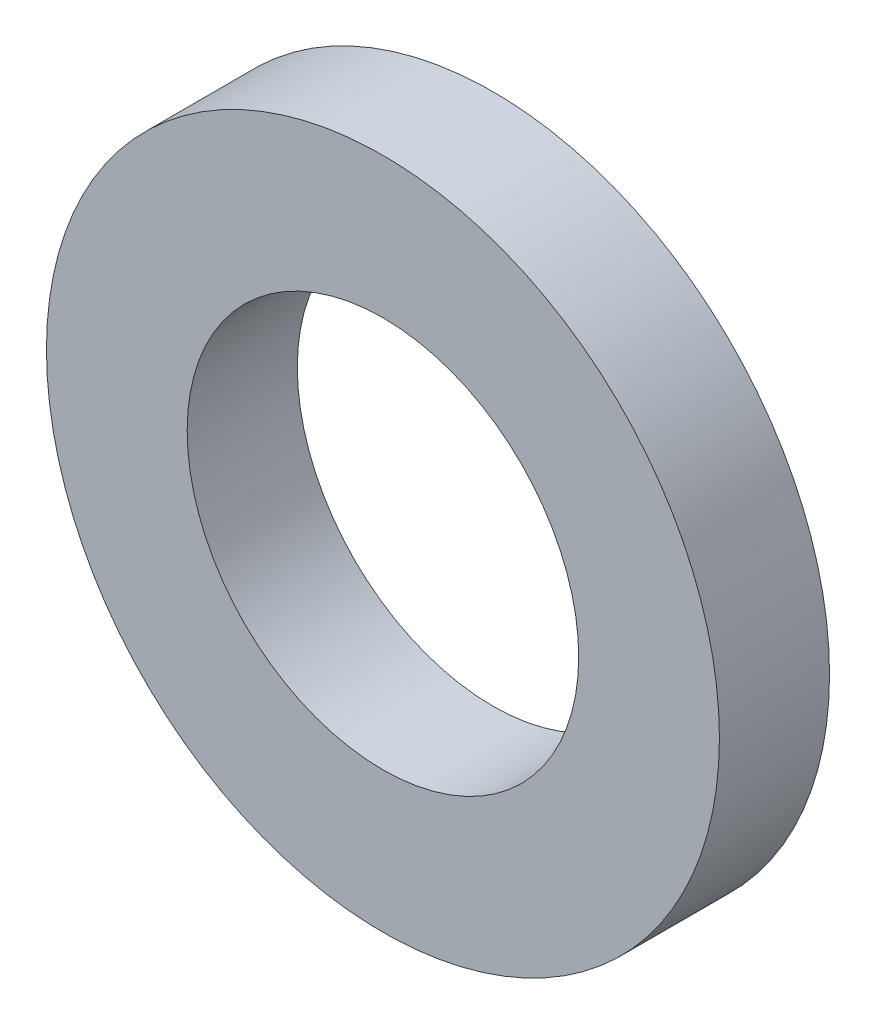
ISO-10303-21;
HEADER;
FILE_DESCRIPTION(('STEP AP214'),'2;1');
FILE_NAME('part.step','',(''),(''),'','','');
FILE_SCHEMA(('AUTOMOTIVE_DESIGN { 1 0 10303 214 1 1 1 1 }'));
ENDSEC;
DATA;
#1=APPLICATION_CONTEXT('core data for automotive mechanical design processes');
#2=APPLICATION_PROTOCOL_DEFINITION('international standard','automotive_design',2000,#1);
#3=PRODUCT_CONTEXT('',#1,'mechanical');
#4=PRODUCT('Part','Part','',(#3));
#5=PRODUCT_RELATED_PRODUCT_CATEGORY('part','',(#4));
#6=PRODUCT_DEFINITION_FORMATION('','',#4);
#7=PRODUCT_DEFINITION_CONTEXT('part definition',#1,'design');
#8=PRODUCT_DEFINITION('design','',#6,#7);
#9=PRODUCT_DEFINITION_SHAPE('','',#8);
#10=(LENGTH_UNIT() NAMED_UNIT(*) SI_UNIT(.MILLI.,.METRE.));
#11=(NAMED_UNIT(*) PLANE_ANGLE_UNIT() SI_UNIT($,.RADIAN.));
#12=(NAMED_UNIT(*) SI_UNIT($,.STERADIAN.) SOLID_ANGLE_UNIT());
#13=UNCERTAINTY_MEASURE_WITH_UNIT(LENGTH_MEASURE(1.E-05),#10,'distance_accuracy_value','');
#14=(GEOMETRIC_REPRESENTATION_CONTEXT(3) GLOBAL_UNCERTAINTY_ASSIGNED_CONTEXT((#13)) GLOBAL_UNIT_ASSIGNED_CONTEXT((#10,
#11,#12)) REPRESENTATION_CONTEXT('',''));
#15=CARTESIAN_POINT('',(0.,0.,0.));
#16=DIRECTION('',(0.,0.,1.));
#17=DIRECTION('',(1.,0.,0.));
#18=AXIS2_PLACEMENT_3D('',#15,#16,#17);
#19=CARTESIAN_POINT('',(0.,0.,1.8));
#20=DIRECTION('',(0.,0.,1.));
#21=DIRECTION('',(1.,0.,0.));
#22=AXIS2_PLACEMENT_3D('',#19,#20,#21);
#23=PLANE('',#22);
#24=CARTESIAN_POINT('',(0.,0.,1.8));
#25=DIRECTION('',(0.,0.,1.));
#26=DIRECTION('',(1.,0.,0.));
#27=AXIS2_PLACEMENT_3D('',#24,#25,#26);
#28=CIRCLE('',#27,5.5);
#29=CARTESIAN_POINT('',(5.5,0.,1.8));
#30=VERTEX_POINT('',#29);
#31=EDGE_CURVE('E10',#30,#30,#28,.T.);
#32=ORIENTED_EDGE('',*,*,#31,.T.);
#33=EDGE_LOOP('',(#32));
#34=FACE_BOUND('',#33,.T.);
#35=CARTESIAN_POINT('',(0.,0.,1.8));
#36=DIRECTION('',(0.,0.,1.));
#37=DIRECTION('',(1.,0.,0.));
#38=AXIS2_PLACEMENT_3D('',#35,#36,#37);
#39=CIRCLE('',#38,3.2);
#40=CARTESIAN_POINT('',(3.2,0.,1.8));
#41=VERTEX_POINT('',#40);
#42=EDGE_CURVE('E44',#41,#41,#39,.T.);
#43=ORIENTED_EDGE('',*,*,#42,.F.);
#44=EDGE_LOOP('',(#43));
#45=FACE_BOUND('',#44,.T.);
#46=ADVANCED_FACE('F33',(#34,#45),#23,.T.);
#47=CARTESIAN_POINT('',(0.,0.,0.));
#48=DIRECTION('',(0.,0.,1.));
#49=DIRECTION('',(1.,0.,0.));
#50=AXIS2_PLACEMENT_3D('',#47,#48,#49);
#51=PLANE('',#50);
#52=CARTESIAN_POINT('',(0.,0.,0.));
#53=DIRECTION('',(0.,0.,1.));
#54=DIRECTION('',(1.,0.,0.));
#55=AXIS2_PLACEMENT_3D('',#52,#53,#54);
#56=CIRCLE('',#55,5.5);
#57=CARTESIAN_POINT('',(5.5,0.,0.));
#58=VERTEX_POINT('',#57);
#59=EDGE_CURVE('E37',#58,#58,#56,.T.);
#60=ORIENTED_EDGE('',*,*,#59,.F.);
#61=EDGE_LOOP('',(#60));
#62=FACE_BOUND('',#61,.T.);
#63=CARTESIAN_POINT('',(0.,0.,0.));
#64=DIRECTION('',(0.,0.,1.));
#65=DIRECTION('',(1.,0.,0.));
#66=AXIS2_PLACEMENT_3D('',#63,#64,#65);
#67=CIRCLE('',#66,3.2);
#68=CARTESIAN_POINT('',(3.2,0.,0.));
#69=VERTEX_POINT('',#68);
#70=EDGE_CURVE('E46',#69,#69,#67,.T.);
#71=ORIENTED_EDGE('',*,*,#70,.T.);
#72=EDGE_LOOP('',(#71));
#73=FACE_BOUND('',#72,.T.);
#74=ADVANCED_FACE('F56',(#62,#73),#51,.F.);
#75=CARTESIAN_POINT('',(0.,0.,1.8));
#76=DIRECTION('',(0.,0.,-1.));
#77=DIRECTION('',(-1.,0.,0.));
#78=AXIS2_PLACEMENT_3D('',#75,#76,#77);
#79=CYLINDRICAL_SURFACE('',#78,5.5);
#80=ORIENTED_EDGE('',*,*,#31,.F.);
#81=EDGE_LOOP('',(#80));
#82=FACE_BOUND('',#81,.T.);
#83=ORIENTED_EDGE('',*,*,#59,.T.);
#84=EDGE_LOOP('',(#83));
#85=FACE_BOUND('',#84,.T.);
#86=ADVANCED_FACE('F35',(#82,#85),#79,.T.);
#87=CARTESIAN_POINT('',(0.,0.,1.8));
#88=DIRECTION('',(0.,0.,-1.));
#89=DIRECTION('',(-1.,0.,0.));
#90=AXIS2_PLACEMENT_3D('',#87,#88,#89);
#91=CYLINDRICAL_SURFACE('',#90,3.2);
#92=ORIENTED_EDGE('',*,*,#42,.T.);
#93=EDGE_LOOP('',(#92));
#94=FACE_BOUND('',#93,.T.);
#95=ORIENTED_EDGE('',*,*,#70,.F.);
#96=EDGE_LOOP('',(#95));
#97=FACE_BOUND('',#96,.T.);
#98=ADVANCED_FACE('F52',(#94,#97),#91,.F.);
#99=CLOSED_SHELL('',(#46,#74,#86,#98));
#100=MANIFOLD_SOLID_BREP('B2',#99);
#101=ADVANCED_BREP_SHAPE_REPRESENTATION('',(#18,#100),#14);
#102=SHAPE_DEFINITION_REPRESENTATION(#9,#101);
ENDSEC;
END-ISO-10303-21;
